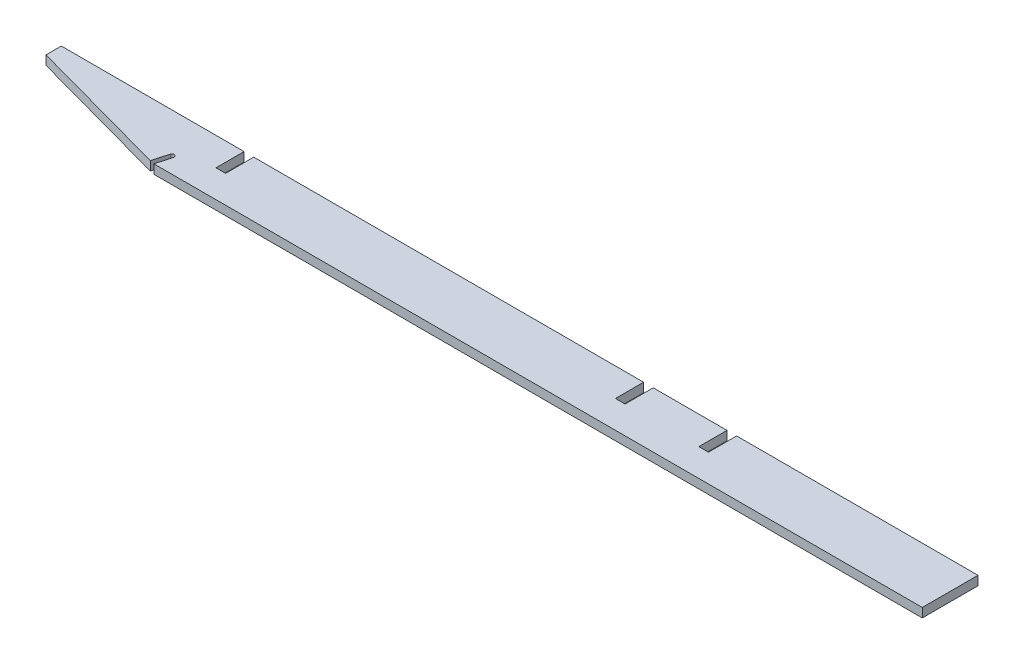
ISO-10303-21;
HEADER;
FILE_DESCRIPTION(('STEP AP214'),'2;1');
FILE_NAME('part.step','',(''),(''),'','','');
FILE_SCHEMA(('AUTOMOTIVE_DESIGN { 1 0 10303 214 1 1 1 1 }'));
ENDSEC;
DATA;
#1=APPLICATION_CONTEXT('core data for automotive mechanical design processes');
#2=APPLICATION_PROTOCOL_DEFINITION('international standard','automotive_design',2000,#1);
#3=PRODUCT_CONTEXT('',#1,'mechanical');
#4=PRODUCT('Part','Part','',(#3));
#5=PRODUCT_RELATED_PRODUCT_CATEGORY('part','',(#4));
#6=PRODUCT_DEFINITION_FORMATION('','',#4);
#7=PRODUCT_DEFINITION_CONTEXT('part definition',#1,'design');
#8=PRODUCT_DEFINITION('design','',#6,#7);
#9=PRODUCT_DEFINITION_SHAPE('','',#8);
#10=(LENGTH_UNIT() NAMED_UNIT(*) SI_UNIT(.MILLI.,.METRE.));
#11=(NAMED_UNIT(*) PLANE_ANGLE_UNIT() SI_UNIT($,.RADIAN.));
#12=(NAMED_UNIT(*) SI_UNIT($,.STERADIAN.) SOLID_ANGLE_UNIT());
#13=UNCERTAINTY_MEASURE_WITH_UNIT(LENGTH_MEASURE(1.E-05),#10,'distance_accuracy_value','');
#14=(GEOMETRIC_REPRESENTATION_CONTEXT(3) GLOBAL_UNCERTAINTY_ASSIGNED_CONTEXT((#13)) GLOBAL_UNIT_ASSIGNED_CONTEXT((#10,
#11,#12)) REPRESENTATION_CONTEXT('',''));
#15=CARTESIAN_POINT('',(0.,0.,0.));
#16=DIRECTION('',(0.,0.,1.));
#17=DIRECTION('',(1.,0.,0.));
#18=AXIS2_PLACEMENT_3D('',#15,#16,#17);
#19=CARTESIAN_POINT('',(-1457.76984888733,841.502,38.1));
#20=DIRECTION('',(-0.26471698178117,0.,0.964326147917118));
#21=DIRECTION('',(0.964326147917118,0.,0.26471698178117));
#22=AXIS2_PLACEMENT_3D('',#19,#20,#21);
#23=PLANE('',#22);
#24=DIRECTION('',(0.964326147917118,0.,0.26471698178117));
#25=VECTOR('',#24,1.);
#26=CARTESIAN_POINT('',(-1457.76984888733,841.502,38.1));
#27=LINE('',#26,#25);
#28=CARTESIAN_POINT('',(-1520.36270603019,841.502,20.9176470588235));
#29=VERTEX_POINT('',#28);
#30=CARTESIAN_POINT('',(-1323.73398806948,841.502,74.8941578715673));
#31=VERTEX_POINT('',#30);
#32=EDGE_CURVE('E298',#29,#31,#27,.T.);
#33=ORIENTED_EDGE('',*,*,#32,.T.);
#34=DIRECTION('',(0.,1.,0.));
#35=VECTOR('',#34,1.);
#36=CARTESIAN_POINT('',(-1323.73398806948,-2244.13415908109,74.8941578715673));
#37=LINE('',#36,#35);
#38=CARTESIAN_POINT('',(-1323.73398806948,853.948,74.8941578715673));
#39=VERTEX_POINT('',#38);
#40=EDGE_CURVE('E200',#31,#39,#37,.T.);
#41=ORIENTED_EDGE('',*,*,#40,.T.);
#42=DIRECTION('',(0.964326147917118,0.,0.26471698178117));
#43=VECTOR('',#42,1.);
#44=CARTESIAN_POINT('',(-1457.76984888733,853.948,38.1));
#45=LINE('',#44,#43);
#46=CARTESIAN_POINT('',(-1520.36270603019,853.948,20.9176470588235));
#47=VERTEX_POINT('',#46);
#48=EDGE_CURVE('E297',#47,#39,#45,.T.);
#49=ORIENTED_EDGE('',*,*,#48,.F.);
#50=DIRECTION('',(0.,-1.,0.));
#51=VECTOR('',#50,1.);
#52=CARTESIAN_POINT('',(-1520.36270603019,841.502,20.9176470588235));
#53=LINE('',#52,#51);
#54=EDGE_CURVE('E48',#47,#29,#53,.T.);
#55=ORIENTED_EDGE('',*,*,#54,.T.);
#56=EDGE_LOOP('',(#33,#41,#49,#55));
#57=FACE_BOUND('',#56,.T.);
#58=ADVANCED_FACE('F16',(#57),#23,.T.);
#59=CARTESIAN_POINT('',(-269.875,841.502,76.2));
#60=DIRECTION('',(0.,0.,-1.));
#61=DIRECTION('',(-1.,0.,0.));
#62=AXIS2_PLACEMENT_3D('',#59,#60,#61);
#63=PLANE('',#62);
#64=DIRECTION('',(0.,1.,0.));
#65=VECTOR('',#64,1.);
#66=CARTESIAN_POINT('',(-1317.50754546389,841.502,76.2));
#67=LINE('',#66,#65);
#68=CARTESIAN_POINT('',(-1317.50754546389,841.502,76.2));
#69=VERTEX_POINT('',#68);
#70=CARTESIAN_POINT('',(-1317.50754546389,853.948,76.2));
#71=VERTEX_POINT('',#70);
#72=EDGE_CURVE('E220',#69,#71,#67,.T.);
#73=ORIENTED_EDGE('',*,*,#72,.F.);
#74=DIRECTION('',(-1.,0.,0.));
#75=VECTOR('',#74,1.);
#76=CARTESIAN_POINT('',(-269.875,841.502,76.2));
#77=LINE('',#76,#75);
#78=CARTESIAN_POINT('',(-266.7,841.502,76.2));
#79=VERTEX_POINT('',#78);
#80=EDGE_CURVE('E312',#79,#69,#77,.T.);
#81=ORIENTED_EDGE('',*,*,#80,.F.);
#82=DIRECTION('',(0.,1.,0.));
#83=VECTOR('',#82,1.);
#84=CARTESIAN_POINT('',(-266.7,841.502,76.2));
#85=LINE('',#84,#83);
#86=CARTESIAN_POINT('',(-266.7,853.948,76.2));
#87=VERTEX_POINT('',#86);
#88=EDGE_CURVE('E315',#79,#87,#85,.T.);
#89=ORIENTED_EDGE('',*,*,#88,.T.);
#90=DIRECTION('',(-1.,0.,0.));
#91=VECTOR('',#90,1.);
#92=CARTESIAN_POINT('',(-269.875,853.948,76.2));
#93=LINE('',#92,#91);
#94=EDGE_CURVE('E302',#87,#71,#93,.T.);
#95=ORIENTED_EDGE('',*,*,#94,.T.);
#96=EDGE_LOOP('',(#73,#81,#89,#95));
#97=FACE_BOUND('',#96,.T.);
#98=ADVANCED_FACE('F404',(#97),#63,.F.);
#99=CARTESIAN_POINT('',(-931.631353015096,841.502,38.1));
#100=DIRECTION('',(0.,-1.,0.));
#101=DIRECTION('',(1.,0.,0.));
#102=AXIS2_PLACEMENT_3D('',#99,#100,#101);
#103=PLANE('',#102);
#104=ORIENTED_EDGE('',*,*,#80,.T.);
#105=DIRECTION('',(0.26471698178117,0.,-0.964326147917118));
#106=VECTOR('',#105,1.);
#107=CARTESIAN_POINT('',(-1280.74131960763,841.502,-57.7341084763812));
#108=LINE('',#107,#106);
#109=CARTESIAN_POINT('',(-1311.72718211012,841.502,55.1429620684198));
#110=VERTEX_POINT('',#109);
#111=EDGE_CURVE('E218',#69,#110,#108,.T.);
#112=ORIENTED_EDGE('',*,*,#111,.T.);
#113=CARTESIAN_POINT('',(-1314.78891762976,841.502,54.3024856512645));
#114=DIRECTION('',(0.,-1.,0.));
#115=DIRECTION('',(0.,0.,-1.));
#116=AXIS2_PLACEMENT_3D('',#113,#114,#115);
#117=CIRCLE('',#116,3.175);
#118=CARTESIAN_POINT('',(-1317.8506531494,841.502,53.4620092341093));
#119=VERTEX_POINT('',#118);
#120=EDGE_CURVE('E204',#119,#110,#117,.T.);
#121=ORIENTED_EDGE('',*,*,#120,.F.);
#122=DIRECTION('',(0.26471698178117,0.,-0.964326147917118));
#123=VECTOR('',#122,1.);
#124=CARTESIAN_POINT('',(-1286.8647906469,841.502,-59.4150613106916));
#125=LINE('',#124,#123);
#126=EDGE_CURVE('E197',#31,#119,#125,.T.);
#127=ORIENTED_EDGE('',*,*,#126,.F.);
#128=ORIENTED_EDGE('',*,*,#32,.F.);
#129=DIRECTION('',(0.,0.,1.));
#130=VECTOR('',#129,1.);
#131=CARTESIAN_POINT('',(-1520.36270603019,841.502,38.1));
#132=LINE('',#131,#130);
#133=CARTESIAN_POINT('',(-1520.36270603019,841.502,0.));
#134=VERTEX_POINT('',#133);
#135=EDGE_CURVE('E382',#29,#134,#132,.F.);
#136=ORIENTED_EDGE('',*,*,#135,.T.);
#137=DIRECTION('',(-1.,0.,0.));
#138=VECTOR('',#137,1.);
#139=CARTESIAN_POINT('',(-931.631353015096,841.502,0.));
#140=LINE('',#139,#138);
#141=CARTESIAN_POINT('',(-1270.381,841.502,0.));
#142=VERTEX_POINT('',#141);
#143=EDGE_CURVE('E301',#142,#134,#140,.T.);
#144=ORIENTED_EDGE('',*,*,#143,.F.);
#145=DIRECTION('',(0.,0.,-1.));
#146=VECTOR('',#145,1.);
#147=CARTESIAN_POINT('',(-1270.381,841.502,38.1));
#148=LINE('',#147,#146);
#149=CARTESIAN_POINT('',(-1270.381,841.502,38.481));
#150=VERTEX_POINT('',#149);
#151=EDGE_CURVE('E264',#150,#142,#148,.T.);
#152=ORIENTED_EDGE('',*,*,#151,.F.);
#153=DIRECTION('',(-1.,0.,0.));
#154=VECTOR('',#153,1.);
#155=CARTESIAN_POINT('',(-931.631353015096,841.502,38.481));
#156=LINE('',#155,#154);
#157=CARTESIAN_POINT('',(-1257.173,841.502,38.481));
#158=VERTEX_POINT('',#157);
#159=EDGE_CURVE('E258',#158,#150,#156,.T.);
#160=ORIENTED_EDGE('',*,*,#159,.F.);
#161=DIRECTION('',(0.,0.,1.));
#162=VECTOR('',#161,1.);
#163=CARTESIAN_POINT('',(-1257.173,841.502,38.1));
#164=LINE('',#163,#162);
#165=CARTESIAN_POINT('',(-1257.173,841.502,0.));
#166=VERTEX_POINT('',#165);
#167=EDGE_CURVE('E255',#166,#158,#164,.T.);
#168=ORIENTED_EDGE('',*,*,#167,.F.);
#169=CARTESIAN_POINT('',(-724.027,841.502,0.));
#170=VERTEX_POINT('',#169);
#171=EDGE_CURVE('E454',#170,#166,#140,.T.);
#172=ORIENTED_EDGE('',*,*,#171,.F.);
#173=DIRECTION('',(0.,0.,-1.));
#174=VECTOR('',#173,1.);
#175=CARTESIAN_POINT('',(-724.027,841.502,38.1));
#176=LINE('',#175,#174);
#177=CARTESIAN_POINT('',(-724.027,841.502,38.481));
#178=VERTEX_POINT('',#177);
#179=EDGE_CURVE('E279',#178,#170,#176,.T.);
#180=ORIENTED_EDGE('',*,*,#179,.F.);
#181=DIRECTION('',(-1.,0.,0.));
#182=VECTOR('',#181,1.);
#183=CARTESIAN_POINT('',(-931.631353015096,841.502,38.481));
#184=LINE('',#183,#182);
#185=CARTESIAN_POINT('',(-710.819,841.502,38.481));
#186=VERTEX_POINT('',#185);
#187=EDGE_CURVE('E273',#186,#178,#184,.T.);
#188=ORIENTED_EDGE('',*,*,#187,.F.);
#189=DIRECTION('',(0.,0.,1.));
#190=VECTOR('',#189,1.);
#191=CARTESIAN_POINT('',(-710.819,841.502,38.1));
#192=LINE('',#191,#190);
#193=CARTESIAN_POINT('',(-710.819,841.502,0.));
#194=VERTEX_POINT('',#193);
#195=EDGE_CURVE('E270',#194,#186,#192,.T.);
#196=ORIENTED_EDGE('',*,*,#195,.F.);
#197=CARTESIAN_POINT('',(-609.981,841.502,0.));
#198=VERTEX_POINT('',#197);
#199=EDGE_CURVE('E308',#198,#194,#140,.T.);
#200=ORIENTED_EDGE('',*,*,#199,.F.);
#201=DIRECTION('',(0.,0.,-1.));
#202=VECTOR('',#201,1.);
#203=CARTESIAN_POINT('',(-609.981,841.502,38.1));
#204=LINE('',#203,#202);
#205=CARTESIAN_POINT('',(-609.981,841.502,38.481));
#206=VERTEX_POINT('',#205);
#207=EDGE_CURVE('E285',#206,#198,#204,.T.);
#208=ORIENTED_EDGE('',*,*,#207,.F.);
#209=DIRECTION('',(-1.,0.,0.));
#210=VECTOR('',#209,1.);
#211=CARTESIAN_POINT('',(-931.631353015096,841.502,38.481));
#212=LINE('',#211,#210);
#213=CARTESIAN_POINT('',(-596.773,841.502,38.481));
#214=VERTEX_POINT('',#213);
#215=EDGE_CURVE('E294',#214,#206,#212,.T.);
#216=ORIENTED_EDGE('',*,*,#215,.F.);
#217=DIRECTION('',(0.,0.,1.));
#218=VECTOR('',#217,1.);
#219=CARTESIAN_POINT('',(-596.773,841.502,38.1));
#220=LINE('',#219,#218);
#221=CARTESIAN_POINT('',(-596.773,841.502,0.));
#222=VERTEX_POINT('',#221);
#223=EDGE_CURVE('E291',#222,#214,#220,.T.);
#224=ORIENTED_EDGE('',*,*,#223,.F.);
#225=CARTESIAN_POINT('',(-266.7,841.502,0.));
#226=VERTEX_POINT('',#225);
#227=EDGE_CURVE('E303',#226,#222,#140,.T.);
#228=ORIENTED_EDGE('',*,*,#227,.F.);
#229=DIRECTION('',(0.,0.,-1.));
#230=VECTOR('',#229,1.);
#231=CARTESIAN_POINT('',(-266.7,841.502,38.1));
#232=LINE('',#231,#230);
#233=EDGE_CURVE('E307',#79,#226,#232,.T.);
#234=ORIENTED_EDGE('',*,*,#233,.F.);
#235=EDGE_LOOP('',(#104,#112,#121,#127,#128,#136,#144,#152,#160,#168,#172,#180,#188,#196,#200,
#208,#216,#224,#228,#234));
#236=FACE_BOUND('',#235,.T.);
#237=ADVANCED_FACE('F217',(#236),#103,.T.);
#238=CARTESIAN_POINT('',(-931.631353015096,853.948,38.1));
#239=DIRECTION('',(0.,-1.,0.));
#240=DIRECTION('',(1.,0.,0.));
#241=AXIS2_PLACEMENT_3D('',#238,#239,#240);
#242=PLANE('',#241);
#243=DIRECTION('',(0.26471698178117,0.,-0.964326147917118));
#244=VECTOR('',#243,1.);
#245=CARTESIAN_POINT('',(-1280.74131960763,853.948,-57.7341084763812));
#246=LINE('',#245,#244);
#247=CARTESIAN_POINT('',(-1311.72718211012,853.948,55.1429620684198));
#248=VERTEX_POINT('',#247);
#249=EDGE_CURVE('E11',#71,#248,#246,.T.);
#250=ORIENTED_EDGE('',*,*,#249,.F.);
#251=ORIENTED_EDGE('',*,*,#94,.F.);
#252=DIRECTION('',(0.,0.,-1.));
#253=VECTOR('',#252,1.);
#254=CARTESIAN_POINT('',(-266.7,853.948,38.1));
#255=LINE('',#254,#253);
#256=CARTESIAN_POINT('',(-266.7,853.948,0.));
#257=VERTEX_POINT('',#256);
#258=EDGE_CURVE('E324',#87,#257,#255,.T.);
#259=ORIENTED_EDGE('',*,*,#258,.T.);
#260=DIRECTION('',(-1.,0.,0.));
#261=VECTOR('',#260,1.);
#262=CARTESIAN_POINT('',(-931.631353015096,853.948,0.));
#263=LINE('',#262,#261);
#264=CARTESIAN_POINT('',(-596.773,853.948,0.));
#265=VERTEX_POINT('',#264);
#266=EDGE_CURVE('E320',#257,#265,#263,.T.);
#267=ORIENTED_EDGE('',*,*,#266,.T.);
#268=DIRECTION('',(0.,0.,1.));
#269=VECTOR('',#268,1.);
#270=CARTESIAN_POINT('',(-596.773,853.948,38.1));
#271=LINE('',#270,#269);
#272=CARTESIAN_POINT('',(-596.773,853.948,38.481));
#273=VERTEX_POINT('',#272);
#274=EDGE_CURVE('E369',#265,#273,#271,.T.);
#275=ORIENTED_EDGE('',*,*,#274,.T.);
#276=DIRECTION('',(-1.,0.,0.));
#277=VECTOR('',#276,1.);
#278=CARTESIAN_POINT('',(-931.631353015096,853.948,38.481));
#279=LINE('',#278,#277);
#280=CARTESIAN_POINT('',(-609.981,853.948,38.481));
#281=VERTEX_POINT('',#280);
#282=EDGE_CURVE('E365',#273,#281,#279,.T.);
#283=ORIENTED_EDGE('',*,*,#282,.T.);
#284=DIRECTION('',(0.,0.,-1.));
#285=VECTOR('',#284,1.);
#286=CARTESIAN_POINT('',(-609.981,853.948,38.1));
#287=LINE('',#286,#285);
#288=CARTESIAN_POINT('',(-609.981,853.948,0.));
#289=VERTEX_POINT('',#288);
#290=EDGE_CURVE('E361',#281,#289,#287,.T.);
#291=ORIENTED_EDGE('',*,*,#290,.T.);
#292=CARTESIAN_POINT('',(-710.819,853.948,0.));
#293=VERTEX_POINT('',#292);
#294=EDGE_CURVE('E325',#289,#293,#263,.T.);
#295=ORIENTED_EDGE('',*,*,#294,.T.);
#296=DIRECTION('',(0.,0.,1.));
#297=VECTOR('',#296,1.);
#298=CARTESIAN_POINT('',(-710.819,853.948,38.1));
#299=LINE('',#298,#297);
#300=CARTESIAN_POINT('',(-710.819,853.948,38.481));
#301=VERTEX_POINT('',#300);
#302=EDGE_CURVE('E349',#293,#301,#299,.T.);
#303=ORIENTED_EDGE('',*,*,#302,.T.);
#304=DIRECTION('',(-1.,0.,0.));
#305=VECTOR('',#304,1.);
#306=CARTESIAN_POINT('',(-931.631353015096,853.948,38.481));
#307=LINE('',#306,#305);
#308=CARTESIAN_POINT('',(-724.027,853.948,38.481));
#309=VERTEX_POINT('',#308);
#310=EDGE_CURVE('E353',#301,#309,#307,.T.);
#311=ORIENTED_EDGE('',*,*,#310,.T.);
#312=DIRECTION('',(0.,0.,-1.));
#313=VECTOR('',#312,1.);
#314=CARTESIAN_POINT('',(-724.027,853.948,38.1));
#315=LINE('',#314,#313);
#316=CARTESIAN_POINT('',(-724.027,853.948,0.));
#317=VERTEX_POINT('',#316);
#318=EDGE_CURVE('E357',#309,#317,#315,.T.);
#319=ORIENTED_EDGE('',*,*,#318,.T.);
#320=CARTESIAN_POINT('',(-1257.173,853.948,0.));
#321=VERTEX_POINT('',#320);
#322=EDGE_CURVE('E434',#317,#321,#263,.T.);
#323=ORIENTED_EDGE('',*,*,#322,.T.);
#324=DIRECTION('',(0.,0.,1.));
#325=VECTOR('',#324,1.);
#326=CARTESIAN_POINT('',(-1257.173,853.948,38.1));
#327=LINE('',#326,#325);
#328=CARTESIAN_POINT('',(-1257.173,853.948,38.481));
#329=VERTEX_POINT('',#328);
#330=EDGE_CURVE('E337',#321,#329,#327,.T.);
#331=ORIENTED_EDGE('',*,*,#330,.T.);
#332=DIRECTION('',(-1.,0.,0.));
#333=VECTOR('',#332,1.);
#334=CARTESIAN_POINT('',(-931.631353015096,853.948,38.481));
#335=LINE('',#334,#333);
#336=CARTESIAN_POINT('',(-1270.381,853.948,38.481));
#337=VERTEX_POINT('',#336);
#338=EDGE_CURVE('E341',#329,#337,#335,.T.);
#339=ORIENTED_EDGE('',*,*,#338,.T.);
#340=DIRECTION('',(0.,0.,-1.));
#341=VECTOR('',#340,1.);
#342=CARTESIAN_POINT('',(-1270.381,853.948,38.1));
#343=LINE('',#342,#341);
#344=CARTESIAN_POINT('',(-1270.381,853.948,0.));
#345=VERTEX_POINT('',#344);
#346=EDGE_CURVE('E345',#337,#345,#343,.T.);
#347=ORIENTED_EDGE('',*,*,#346,.T.);
#348=CARTESIAN_POINT('',(-1520.36270603019,853.948,0.));
#349=VERTEX_POINT('',#348);
#350=EDGE_CURVE('E319',#345,#349,#263,.T.);
#351=ORIENTED_EDGE('',*,*,#350,.T.);
#352=DIRECTION('',(0.,0.,-1.));
#353=VECTOR('',#352,1.);
#354=CARTESIAN_POINT('',(-1520.36270603019,853.948,0.));
#355=LINE('',#354,#353);
#356=EDGE_CURVE('E377',#349,#47,#355,.F.);
#357=ORIENTED_EDGE('',*,*,#356,.T.);
#358=ORIENTED_EDGE('',*,*,#48,.T.);
#359=DIRECTION('',(0.26471698178117,0.,-0.964326147917118));
#360=VECTOR('',#359,1.);
#361=CARTESIAN_POINT('',(-1286.8647906469,853.948,-59.4150613106916));
#362=LINE('',#361,#360);
#363=CARTESIAN_POINT('',(-1317.8506531494,853.948,53.4620092341093));
#364=VERTEX_POINT('',#363);
#365=EDGE_CURVE('E385',#39,#364,#362,.T.);
#366=ORIENTED_EDGE('',*,*,#365,.T.);
#367=CARTESIAN_POINT('',(-1314.78891762976,853.948,54.3024856512645));
#368=DIRECTION('',(0.,-1.,0.));
#369=DIRECTION('',(0.,0.,-1.));
#370=AXIS2_PLACEMENT_3D('',#367,#368,#369);
#371=CIRCLE('',#370,3.175);
#372=EDGE_CURVE('E25',#364,#248,#371,.T.);
#373=ORIENTED_EDGE('',*,*,#372,.T.);
#374=EDGE_LOOP('',(#250,#251,#259,#267,#275,#283,#291,#295,#303,#311,#319,#323,#331,#339,#347,
#351,#357,#358,#366,#373));
#375=FACE_BOUND('',#374,.T.);
#376=ADVANCED_FACE('F392',(#375),#242,.F.);
#377=CARTESIAN_POINT('',(-931.631353015096,841.502,0.));
#378=DIRECTION('',(0.,0.,-1.));
#379=DIRECTION('',(-1.,0.,0.));
#380=AXIS2_PLACEMENT_3D('',#377,#378,#379);
#381=PLANE('',#380);
#382=DIRECTION('',(0.,-1.,0.));
#383=VECTOR('',#382,1.);
#384=CARTESIAN_POINT('',(-596.773,841.502,0.));
#385=LINE('',#384,#383);
#386=EDGE_CURVE('E288',#265,#222,#385,.T.);
#387=ORIENTED_EDGE('',*,*,#386,.F.);
#388=ORIENTED_EDGE('',*,*,#266,.F.);
#389=DIRECTION('',(0.,1.,0.));
#390=VECTOR('',#389,1.);
#391=CARTESIAN_POINT('',(-266.7,841.502,0.));
#392=LINE('',#391,#390);
#393=EDGE_CURVE('E334',#226,#257,#392,.T.);
#394=ORIENTED_EDGE('',*,*,#393,.F.);
#395=ORIENTED_EDGE('',*,*,#227,.T.);
#396=EDGE_LOOP('',(#387,#388,#394,#395));
#397=FACE_BOUND('',#396,.T.);
#398=ADVANCED_FACE('F414',(#397),#381,.T.);
#399=DIRECTION('',(0.,1.,0.));
#400=VECTOR('',#399,1.);
#401=CARTESIAN_POINT('',(-724.027,841.502,0.));
#402=LINE('',#401,#400);
#403=EDGE_CURVE('E276',#170,#317,#402,.T.);
#404=ORIENTED_EDGE('',*,*,#403,.F.);
#405=ORIENTED_EDGE('',*,*,#171,.T.);
#406=DIRECTION('',(0.,-1.,0.));
#407=VECTOR('',#406,1.);
#408=CARTESIAN_POINT('',(-1257.173,841.502,0.));
#409=LINE('',#408,#407);
#410=EDGE_CURVE('E241',#321,#166,#409,.T.);
#411=ORIENTED_EDGE('',*,*,#410,.F.);
#412=ORIENTED_EDGE('',*,*,#322,.F.);
#413=EDGE_LOOP('',(#404,#405,#411,#412));
#414=FACE_BOUND('',#413,.T.);
#415=ADVANCED_FACE('F476',(#414),#381,.T.);
#416=ORIENTED_EDGE('',*,*,#143,.T.);
#417=DIRECTION('',(0.,1.,0.));
#418=VECTOR('',#417,1.);
#419=CARTESIAN_POINT('',(-1520.36270603019,841.502,0.));
#420=LINE('',#419,#418);
#421=EDGE_CURVE('E373',#134,#349,#420,.T.);
#422=ORIENTED_EDGE('',*,*,#421,.T.);
#423=ORIENTED_EDGE('',*,*,#350,.F.);
#424=DIRECTION('',(0.,1.,0.));
#425=VECTOR('',#424,1.);
#426=CARTESIAN_POINT('',(-1270.381,841.502,0.));
#427=LINE('',#426,#425);
#428=EDGE_CURVE('E261',#142,#345,#427,.T.);
#429=ORIENTED_EDGE('',*,*,#428,.F.);
#430=EDGE_LOOP('',(#416,#422,#423,#429));
#431=FACE_BOUND('',#430,.T.);
#432=ADVANCED_FACE('F447',(#431),#381,.T.);
#433=DIRECTION('',(0.,1.,0.));
#434=VECTOR('',#433,1.);
#435=CARTESIAN_POINT('',(-609.981,841.502,0.));
#436=LINE('',#435,#434);
#437=EDGE_CURVE('E282',#198,#289,#436,.T.);
#438=ORIENTED_EDGE('',*,*,#437,.F.);
#439=ORIENTED_EDGE('',*,*,#199,.T.);
#440=DIRECTION('',(0.,-1.,0.));
#441=VECTOR('',#440,1.);
#442=CARTESIAN_POINT('',(-710.819,841.502,0.));
#443=LINE('',#442,#441);
#444=EDGE_CURVE('E267',#293,#194,#443,.T.);
#445=ORIENTED_EDGE('',*,*,#444,.F.);
#446=ORIENTED_EDGE('',*,*,#294,.F.);
#447=EDGE_LOOP('',(#438,#439,#445,#446));
#448=FACE_BOUND('',#447,.T.);
#449=ADVANCED_FACE('F431',(#448),#381,.T.);
#450=CARTESIAN_POINT('',(-266.7,841.502,38.1));
#451=DIRECTION('',(1.,0.,0.));
#452=DIRECTION('',(0.,0.,-1.));
#453=AXIS2_PLACEMENT_3D('',#450,#451,#452);
#454=PLANE('',#453);
#455=ORIENTED_EDGE('',*,*,#258,.F.);
#456=ORIENTED_EDGE('',*,*,#88,.F.);
#457=ORIENTED_EDGE('',*,*,#233,.T.);
#458=ORIENTED_EDGE('',*,*,#393,.T.);
#459=EDGE_LOOP('',(#455,#456,#457,#458));
#460=FACE_BOUND('',#459,.T.);
#461=ADVANCED_FACE('F410',(#460),#454,.T.);
#462=CARTESIAN_POINT('',(-936.879,-2244.46058781173,38.481));
#463=DIRECTION('',(0.,0.,1.));
#464=DIRECTION('',(1.,0.,0.));
#465=AXIS2_PLACEMENT_3D('',#462,#463,#464);
#466=PLANE('',#465);
#467=ORIENTED_EDGE('',*,*,#159,.T.);
#468=DIRECTION('',(0.,1.,0.));
#469=VECTOR('',#468,1.);
#470=CARTESIAN_POINT('',(-1270.381,-2244.46058781173,38.481));
#471=LINE('',#470,#469);
#472=EDGE_CURVE('E245',#150,#337,#471,.T.);
#473=ORIENTED_EDGE('',*,*,#472,.T.);
#474=ORIENTED_EDGE('',*,*,#338,.F.);
#475=DIRECTION('',(0.,1.,0.));
#476=VECTOR('',#475,1.);
#477=CARTESIAN_POINT('',(-1257.173,-2244.46058781173,38.481));
#478=LINE('',#477,#476);
#479=EDGE_CURVE('E231',#158,#329,#478,.T.);
#480=ORIENTED_EDGE('',*,*,#479,.F.);
#481=EDGE_LOOP('',(#467,#473,#474,#480));
#482=FACE_BOUND('',#481,.T.);
#483=ADVANCED_FACE('F483',(#482),#466,.F.);
#484=CARTESIAN_POINT('',(-1270.381,-2244.46058781173,38.1));
#485=DIRECTION('',(-1.,0.,0.));
#486=DIRECTION('',(0.,0.,1.));
#487=AXIS2_PLACEMENT_3D('',#484,#485,#486);
#488=PLANE('',#487);
#489=ORIENTED_EDGE('',*,*,#151,.T.);
#490=ORIENTED_EDGE('',*,*,#428,.T.);
#491=ORIENTED_EDGE('',*,*,#346,.F.);
#492=ORIENTED_EDGE('',*,*,#472,.F.);
#493=EDGE_LOOP('',(#489,#490,#491,#492));
#494=FACE_BOUND('',#493,.T.);
#495=ADVANCED_FACE('F486',(#494),#488,.F.);
#496=CARTESIAN_POINT('',(-1257.173,-2244.46058781173,38.1));
#497=DIRECTION('',(1.,0.,0.));
#498=DIRECTION('',(0.,0.,-1.));
#499=AXIS2_PLACEMENT_3D('',#496,#497,#498);
#500=PLANE('',#499);
#501=ORIENTED_EDGE('',*,*,#167,.T.);
#502=ORIENTED_EDGE('',*,*,#479,.T.);
#503=ORIENTED_EDGE('',*,*,#330,.F.);
#504=ORIENTED_EDGE('',*,*,#410,.T.);
#505=EDGE_LOOP('',(#501,#502,#503,#504));
#506=FACE_BOUND('',#505,.T.);
#507=ADVANCED_FACE('F479',(#506),#500,.F.);
#508=CARTESIAN_POINT('',(-936.879,-2244.46058781173,38.481));
#509=DIRECTION('',(0.,0.,1.));
#510=DIRECTION('',(1.,0.,0.));
#511=AXIS2_PLACEMENT_3D('',#508,#509,#510);
#512=PLANE('',#511);
#513=ORIENTED_EDGE('',*,*,#187,.T.);
#514=DIRECTION('',(0.,1.,0.));
#515=VECTOR('',#514,1.);
#516=CARTESIAN_POINT('',(-724.027,-2244.46058781173,38.481));
#517=LINE('',#516,#515);
#518=EDGE_CURVE('E237',#178,#309,#517,.T.);
#519=ORIENTED_EDGE('',*,*,#518,.T.);
#520=ORIENTED_EDGE('',*,*,#310,.F.);
#521=DIRECTION('',(0.,1.,0.));
#522=VECTOR('',#521,1.);
#523=CARTESIAN_POINT('',(-710.819,-2244.46058781173,38.481));
#524=LINE('',#523,#522);
#525=EDGE_CURVE('E242',#186,#301,#524,.T.);
#526=ORIENTED_EDGE('',*,*,#525,.F.);
#527=EDGE_LOOP('',(#513,#519,#520,#526));
#528=FACE_BOUND('',#527,.T.);
#529=ADVANCED_FACE('F473',(#528),#512,.F.);
#530=CARTESIAN_POINT('',(-724.027,-2244.46058781173,38.1));
#531=DIRECTION('',(-1.,0.,0.));
#532=DIRECTION('',(0.,0.,1.));
#533=AXIS2_PLACEMENT_3D('',#530,#531,#532);
#534=PLANE('',#533);
#535=ORIENTED_EDGE('',*,*,#179,.T.);
#536=ORIENTED_EDGE('',*,*,#403,.T.);
#537=ORIENTED_EDGE('',*,*,#318,.F.);
#538=ORIENTED_EDGE('',*,*,#518,.F.);
#539=EDGE_LOOP('',(#535,#536,#537,#538));
#540=FACE_BOUND('',#539,.T.);
#541=ADVANCED_FACE('F574',(#540),#534,.F.);
#542=CARTESIAN_POINT('',(-710.819,-2244.46058781173,38.1));
#543=DIRECTION('',(1.,0.,0.));
#544=DIRECTION('',(0.,0.,-1.));
#545=AXIS2_PLACEMENT_3D('',#542,#543,#544);
#546=PLANE('',#545);
#547=ORIENTED_EDGE('',*,*,#195,.T.);
#548=ORIENTED_EDGE('',*,*,#525,.T.);
#549=ORIENTED_EDGE('',*,*,#302,.F.);
#550=ORIENTED_EDGE('',*,*,#444,.T.);
#551=EDGE_LOOP('',(#547,#548,#549,#550));
#552=FACE_BOUND('',#551,.T.);
#553=ADVANCED_FACE('F470',(#552),#546,.F.);
#554=CARTESIAN_POINT('',(-936.879,-2244.46058781173,38.481));
#555=DIRECTION('',(0.,0.,1.));
#556=DIRECTION('',(1.,0.,0.));
#557=AXIS2_PLACEMENT_3D('',#554,#555,#556);
#558=PLANE('',#557);
#559=ORIENTED_EDGE('',*,*,#215,.T.);
#560=DIRECTION('',(0.,1.,0.));
#561=VECTOR('',#560,1.);
#562=CARTESIAN_POINT('',(-609.981,-2244.46058781173,38.481));
#563=LINE('',#562,#561);
#564=EDGE_CURVE('E232',#206,#281,#563,.T.);
#565=ORIENTED_EDGE('',*,*,#564,.T.);
#566=ORIENTED_EDGE('',*,*,#282,.F.);
#567=DIRECTION('',(0.,1.,0.));
#568=VECTOR('',#567,1.);
#569=CARTESIAN_POINT('',(-596.773,-2244.46058781173,38.481));
#570=LINE('',#569,#568);
#571=EDGE_CURVE('E236',#214,#273,#570,.T.);
#572=ORIENTED_EDGE('',*,*,#571,.F.);
#573=EDGE_LOOP('',(#559,#565,#566,#572));
#574=FACE_BOUND('',#573,.T.);
#575=ADVANCED_FACE('F423',(#574),#558,.F.);
#576=CARTESIAN_POINT('',(-596.773,-2244.46058781173,38.1));
#577=DIRECTION('',(1.,0.,0.));
#578=DIRECTION('',(0.,0.,-1.));
#579=AXIS2_PLACEMENT_3D('',#576,#577,#578);
#580=PLANE('',#579);
#581=ORIENTED_EDGE('',*,*,#223,.T.);
#582=ORIENTED_EDGE('',*,*,#571,.T.);
#583=ORIENTED_EDGE('',*,*,#274,.F.);
#584=ORIENTED_EDGE('',*,*,#386,.T.);
#585=EDGE_LOOP('',(#581,#582,#583,#584));
#586=FACE_BOUND('',#585,.T.);
#587=ADVANCED_FACE('F416',(#586),#580,.F.);
#588=CARTESIAN_POINT('',(-609.981,-2244.46058781173,38.1));
#589=DIRECTION('',(-1.,0.,0.));
#590=DIRECTION('',(0.,0.,1.));
#591=AXIS2_PLACEMENT_3D('',#588,#589,#590);
#592=PLANE('',#591);
#593=ORIENTED_EDGE('',*,*,#207,.T.);
#594=ORIENTED_EDGE('',*,*,#437,.T.);
#595=ORIENTED_EDGE('',*,*,#290,.F.);
#596=ORIENTED_EDGE('',*,*,#564,.F.);
#597=EDGE_LOOP('',(#593,#594,#595,#596));
#598=FACE_BOUND('',#597,.T.);
#599=ADVANCED_FACE('F425',(#598),#592,.F.);
#600=CARTESIAN_POINT('',(-1520.36270603019,841.502,0.));
#601=DIRECTION('',(1.,0.,0.));
#602=DIRECTION('',(0.,1.,0.));
#603=AXIS2_PLACEMENT_3D('',#600,#601,#602);
#604=PLANE('',#603);
#605=ORIENTED_EDGE('',*,*,#135,.F.);
#606=ORIENTED_EDGE('',*,*,#54,.F.);
#607=ORIENTED_EDGE('',*,*,#356,.F.);
#608=ORIENTED_EDGE('',*,*,#421,.F.);
#609=EDGE_LOOP('',(#605,#606,#607,#608));
#610=FACE_BOUND('',#609,.T.);
#611=ADVANCED_FACE('F18',(#610),#604,.F.);
#612=CARTESIAN_POINT('',(-1314.78891762976,-2244.13415908109,54.3024856512645));
#613=DIRECTION('',(0.,1.,0.));
#614=DIRECTION('',(0.,0.,1.));
#615=AXIS2_PLACEMENT_3D('',#612,#613,#614);
#616=CYLINDRICAL_SURFACE('',#615,3.175);
#617=ORIENTED_EDGE('',*,*,#120,.T.);
#618=DIRECTION('',(0.,1.,0.));
#619=VECTOR('',#618,1.);
#620=CARTESIAN_POINT('',(-1311.72718211012,-2244.13415908109,55.1429620684198));
#621=LINE('',#620,#619);
#622=EDGE_CURVE('E205',#110,#248,#621,.T.);
#623=ORIENTED_EDGE('',*,*,#622,.T.);
#624=ORIENTED_EDGE('',*,*,#372,.F.);
#625=DIRECTION('',(0.,1.,0.));
#626=VECTOR('',#625,1.);
#627=CARTESIAN_POINT('',(-1317.8506531494,-2244.13415908109,53.4620092341093));
#628=LINE('',#627,#626);
#629=EDGE_CURVE('E37',#119,#364,#628,.T.);
#630=ORIENTED_EDGE('',*,*,#629,.F.);
#631=EDGE_LOOP('',(#617,#623,#624,#630));
#632=FACE_BOUND('',#631,.T.);
#633=ADVANCED_FACE('F208',(#632),#616,.F.);
#634=CARTESIAN_POINT('',(-1322.04912757286,-2244.13415908109,68.7564517767437));
#635=DIRECTION('',(-0.964326147917118,0.,-0.26471698178117));
#636=DIRECTION('',(-0.26471698178117,0.,0.964326147917118));
#637=AXIS2_PLACEMENT_3D('',#634,#635,#636);
#638=PLANE('',#637);
#639=ORIENTED_EDGE('',*,*,#126,.T.);
#640=ORIENTED_EDGE('',*,*,#629,.T.);
#641=ORIENTED_EDGE('',*,*,#365,.F.);
#642=ORIENTED_EDGE('',*,*,#40,.F.);
#643=EDGE_LOOP('',(#639,#640,#641,#642));
#644=FACE_BOUND('',#643,.T.);
#645=ADVANCED_FACE('F198',(#644),#638,.F.);
#646=CARTESIAN_POINT('',(-1314.05853794334,-2244.13415908109,63.6357583179992));
#647=DIRECTION('',(-0.964326147917118,0.,-0.26471698178117));
#648=DIRECTION('',(-0.26471698178117,0.,0.964326147917118));
#649=AXIS2_PLACEMENT_3D('',#646,#647,#648);
#650=PLANE('',#649);
#651=ORIENTED_EDGE('',*,*,#72,.T.);
#652=ORIENTED_EDGE('',*,*,#249,.T.);
#653=ORIENTED_EDGE('',*,*,#622,.F.);
#654=ORIENTED_EDGE('',*,*,#111,.F.);
#655=EDGE_LOOP('',(#651,#652,#653,#654));
#656=FACE_BOUND('',#655,.T.);
#657=ADVANCED_FACE('F400',(#656),#650,.T.);
#658=CLOSED_SHELL('',(#58,#98,#237,#376,#398,#415,#432,#449,#461,#483,#495,#507,#529,#541,#553,
#575,#587,#599,#611,#633,#645,#657));
#659=MANIFOLD_SOLID_BREP('B1',#658);
#660=ADVANCED_BREP_SHAPE_REPRESENTATION('',(#18,#659),#14);
#661=SHAPE_DEFINITION_REPRESENTATION(#9,#660);
ENDSEC;
END-ISO-10303-21;
